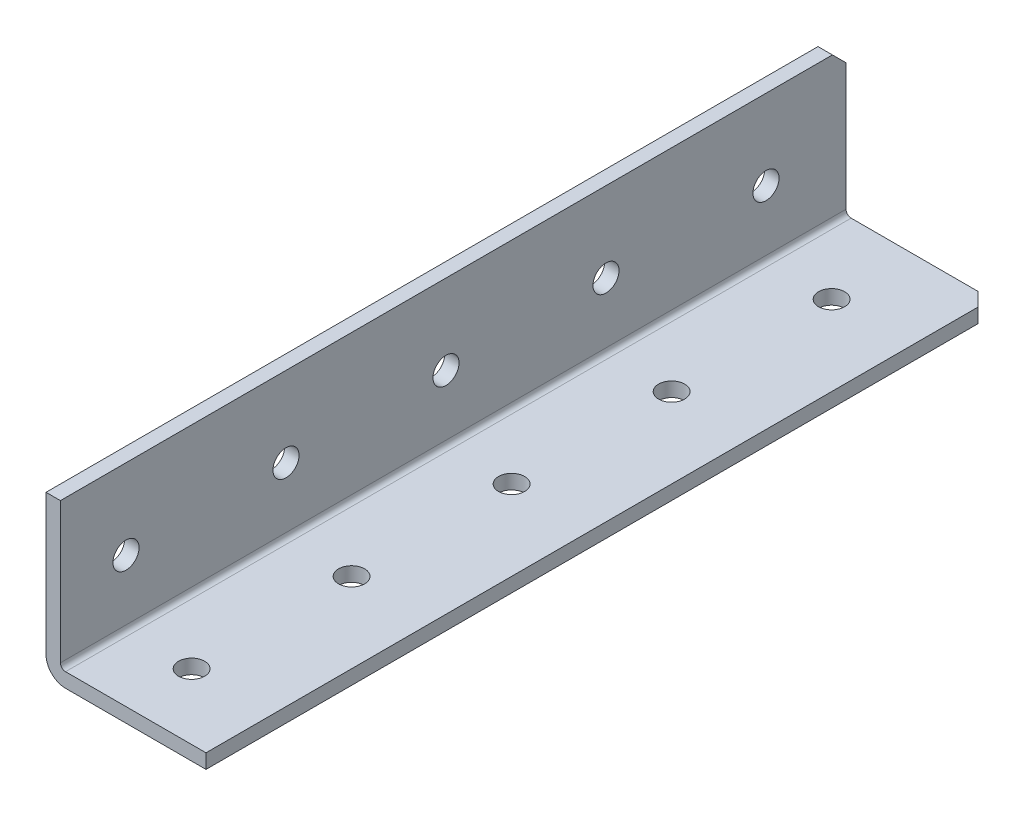
ISO-10303-21;
HEADER;
FILE_DESCRIPTION(('STEP AP214'),'2;1');
FILE_NAME('part.step','',(''),(''),'','','');
FILE_SCHEMA(('AUTOMOTIVE_DESIGN { 1 0 10303 214 1 1 1 1 }'));
ENDSEC;
DATA;
#1=APPLICATION_CONTEXT('core data for automotive mechanical design processes');
#2=APPLICATION_PROTOCOL_DEFINITION('international standard','automotive_design',2000,#1);
#3=PRODUCT_CONTEXT('',#1,'mechanical');
#4=PRODUCT('Part','Part','',(#3));
#5=PRODUCT_RELATED_PRODUCT_CATEGORY('part','',(#4));
#6=PRODUCT_DEFINITION_FORMATION('','',#4);
#7=PRODUCT_DEFINITION_CONTEXT('part definition',#1,'design');
#8=PRODUCT_DEFINITION('design','',#6,#7);
#9=PRODUCT_DEFINITION_SHAPE('','',#8);
#10=(LENGTH_UNIT() NAMED_UNIT(*) SI_UNIT(.MILLI.,.METRE.));
#11=(NAMED_UNIT(*) PLANE_ANGLE_UNIT() SI_UNIT($,.RADIAN.));
#12=(NAMED_UNIT(*) SI_UNIT($,.STERADIAN.) SOLID_ANGLE_UNIT());
#13=UNCERTAINTY_MEASURE_WITH_UNIT(LENGTH_MEASURE(1.E-05),#10,'distance_accuracy_value','');
#14=(GEOMETRIC_REPRESENTATION_CONTEXT(3) GLOBAL_UNCERTAINTY_ASSIGNED_CONTEXT((#13)) GLOBAL_UNIT_ASSIGNED_CONTEXT((#10,
#11,#12)) REPRESENTATION_CONTEXT('',''));
#15=CARTESIAN_POINT('',(0.,0.,0.));
#16=DIRECTION('',(0.,0.,1.));
#17=DIRECTION('',(1.,0.,0.));
#18=AXIS2_PLACEMENT_3D('',#15,#16,#17);
#19=CARTESIAN_POINT('',(25.4,0.,-749.3));
#20=DIRECTION('',(0.,-1.,0.));
#21=DIRECTION('',(0.,0.,-1.));
#22=AXIS2_PLACEMENT_3D('',#19,#20,#21);
#23=PLANE('',#22);
#24=DIRECTION('',(1.,0.,0.));
#25=VECTOR('',#24,1.);
#26=CARTESIAN_POINT('',(25.4,0.,-624.586));
#27=LINE('',#26,#25);
#28=CARTESIAN_POINT('',(3.0988,0.,-624.586));
#29=VERTEX_POINT('',#28);
#30=CARTESIAN_POINT('',(25.4,0.,-624.586));
#31=VERTEX_POINT('',#30);
#32=EDGE_CURVE('E110',#29,#31,#27,.T.);
#33=ORIENTED_EDGE('',*,*,#32,.F.);
#34=DIRECTION('',(0.,0.,1.));
#35=VECTOR('',#34,1.);
#36=CARTESIAN_POINT('',(3.0988,0.,-749.3));
#37=LINE('',#36,#35);
#38=CARTESIAN_POINT('',(3.0988,0.,-749.3));
#39=VERTEX_POINT('',#38);
#40=EDGE_CURVE('E56',#29,#39,#37,.F.);
#41=ORIENTED_EDGE('',*,*,#40,.T.);
#42=DIRECTION('',(-1.,0.,0.));
#43=VECTOR('',#42,1.);
#44=CARTESIAN_POINT('',(25.4,0.,-749.3));
#45=LINE('',#44,#43);
#46=CARTESIAN_POINT('',(23.2409999999998,0.,-749.3));
#47=VERTEX_POINT('',#46);
#48=EDGE_CURVE('E155',#47,#39,#45,.T.);
#49=ORIENTED_EDGE('',*,*,#48,.F.);
#50=DIRECTION('',(0.707106781186584,0.,0.707106781186511));
#51=VECTOR('',#50,1.);
#52=CARTESIAN_POINT('',(24.3205,0.,-748.2205));
#53=LINE('',#52,#51);
#54=CARTESIAN_POINT('',(25.4,0.,-747.141));
#55=VERTEX_POINT('',#54);
#56=EDGE_CURVE('E147',#47,#55,#53,.T.);
#57=ORIENTED_EDGE('',*,*,#56,.T.);
#58=DIRECTION('',(0.,0.,1.));
#59=VECTOR('',#58,1.);
#60=CARTESIAN_POINT('',(25.4,0.,-749.3));
#61=LINE('',#60,#59);
#62=EDGE_CURVE('E118',#55,#31,#61,.T.);
#63=ORIENTED_EDGE('',*,*,#62,.T.);
#64=EDGE_LOOP('',(#33,#41,#49,#57,#63));
#65=FACE_BOUND('',#64,.T.);
#66=CARTESIAN_POINT('',(12.7,0.,-736.6));
#67=DIRECTION('',(0.,-1.,0.));
#68=DIRECTION('',(0.,0.,-1.));
#69=AXIS2_PLACEMENT_3D('',#66,#67,#68);
#70=CIRCLE('',#69,2.07009999999995);
#71=CARTESIAN_POINT('',(12.7,0.,-738.6701));
#72=VERTEX_POINT('',#71);
#73=EDGE_CURVE('E160',#72,#72,#70,.T.);
#74=ORIENTED_EDGE('',*,*,#73,.F.);
#75=EDGE_LOOP('',(#74));
#76=FACE_BOUND('',#75,.T.);
#77=CARTESIAN_POINT('',(12.7,0.,-711.2));
#78=DIRECTION('',(0.,-1.,0.));
#79=DIRECTION('',(0.,0.,-1.));
#80=AXIS2_PLACEMENT_3D('',#77,#78,#79);
#81=CIRCLE('',#80,2.07009999999995);
#82=CARTESIAN_POINT('',(12.7,0.,-713.2701));
#83=VERTEX_POINT('',#82);
#84=EDGE_CURVE('E159',#83,#83,#81,.T.);
#85=ORIENTED_EDGE('',*,*,#84,.F.);
#86=EDGE_LOOP('',(#85));
#87=FACE_BOUND('',#86,.T.);
#88=CARTESIAN_POINT('',(12.7,0.,-685.8));
#89=DIRECTION('',(0.,-1.,0.));
#90=DIRECTION('',(0.,0.,-1.));
#91=AXIS2_PLACEMENT_3D('',#88,#89,#90);
#92=CIRCLE('',#91,2.07009999999995);
#93=CARTESIAN_POINT('',(12.7,0.,-687.8701));
#94=VERTEX_POINT('',#93);
#95=EDGE_CURVE('E192',#94,#94,#92,.T.);
#96=ORIENTED_EDGE('',*,*,#95,.F.);
#97=EDGE_LOOP('',(#96));
#98=FACE_BOUND('',#97,.T.);
#99=CARTESIAN_POINT('',(12.7,0.,-660.4));
#100=DIRECTION('',(0.,-1.,0.));
#101=DIRECTION('',(0.,0.,-1.));
#102=AXIS2_PLACEMENT_3D('',#99,#100,#101);
#103=CIRCLE('',#102,2.07009999999995);
#104=CARTESIAN_POINT('',(12.7,0.,-662.4701));
#105=VERTEX_POINT('',#104);
#106=EDGE_CURVE('E186',#105,#105,#103,.T.);
#107=ORIENTED_EDGE('',*,*,#106,.F.);
#108=EDGE_LOOP('',(#107));
#109=FACE_BOUND('',#108,.T.);
#110=CARTESIAN_POINT('',(12.7,0.,-635.));
#111=DIRECTION('',(0.,-1.,0.));
#112=DIRECTION('',(0.,0.,-1.));
#113=AXIS2_PLACEMENT_3D('',#110,#111,#112);
#114=CIRCLE('',#113,2.07009999999995);
#115=CARTESIAN_POINT('',(12.7,0.,-637.0701));
#116=VERTEX_POINT('',#115);
#117=EDGE_CURVE('E180',#116,#116,#114,.T.);
#118=ORIENTED_EDGE('',*,*,#117,.F.);
#119=EDGE_LOOP('',(#118));
#120=FACE_BOUND('',#119,.T.);
#121=ADVANCED_FACE('F34',(#65,#76,#87,#98,#109,#120),#23,.T.);
#122=CARTESIAN_POINT('',(25.4,25.4,-749.3));
#123=DIRECTION('',(0.,0.,-1.));
#124=DIRECTION('',(-1.,0.,0.));
#125=AXIS2_PLACEMENT_3D('',#122,#123,#124);
#126=PLANE('',#125);
#127=ORIENTED_EDGE('',*,*,#48,.T.);
#128=CARTESIAN_POINT('',(3.0988,3.0988,-749.3));
#129=DIRECTION('',(0.,0.,-1.));
#130=DIRECTION('',(-1.,0.,0.));
#131=AXIS2_PLACEMENT_3D('',#128,#129,#130);
#132=CIRCLE('',#131,3.0988);
#133=CARTESIAN_POINT('',(0.,3.0988,-749.3));
#134=VERTEX_POINT('',#133);
#135=EDGE_CURVE('E42',#39,#134,#132,.T.);
#136=ORIENTED_EDGE('',*,*,#135,.T.);
#137=DIRECTION('',(0.,-1.,0.));
#138=VECTOR('',#137,1.);
#139=CARTESIAN_POINT('',(0.,25.4,-749.3));
#140=LINE('',#139,#138);
#141=CARTESIAN_POINT('',(0.,23.241,-749.3));
#142=VERTEX_POINT('',#141);
#143=EDGE_CURVE('E162',#142,#134,#140,.T.);
#144=ORIENTED_EDGE('',*,*,#143,.F.);
#145=DIRECTION('',(1.,0.,0.));
#146=VECTOR('',#145,1.);
#147=CARTESIAN_POINT('',(25.4,23.241,-749.3));
#148=LINE('',#147,#146);
#149=CARTESIAN_POINT('',(2.286,23.241,-749.3));
#150=VERTEX_POINT('',#149);
#151=EDGE_CURVE('E152',#142,#150,#148,.T.);
#152=ORIENTED_EDGE('',*,*,#151,.T.);
#153=DIRECTION('',(0.,1.,0.));
#154=VECTOR('',#153,1.);
#155=CARTESIAN_POINT('',(2.286,2.286,-749.3));
#156=LINE('',#155,#154);
#157=CARTESIAN_POINT('',(2.286,3.0988,-749.3));
#158=VERTEX_POINT('',#157);
#159=EDGE_CURVE('E171',#158,#150,#156,.T.);
#160=ORIENTED_EDGE('',*,*,#159,.F.);
#161=CARTESIAN_POINT('',(3.0988,3.0988,-749.3));
#162=DIRECTION('',(0.,0.,-1.));
#163=DIRECTION('',(-1.,0.,0.));
#164=AXIS2_PLACEMENT_3D('',#161,#162,#163);
#165=CIRCLE('',#164,0.8128);
#166=CARTESIAN_POINT('',(3.0988,2.286,-749.3));
#167=VERTEX_POINT('',#166);
#168=EDGE_CURVE('E125',#158,#167,#165,.F.);
#169=ORIENTED_EDGE('',*,*,#168,.T.);
#170=DIRECTION('',(-1.,0.,0.));
#171=VECTOR('',#170,1.);
#172=CARTESIAN_POINT('',(25.4,2.286,-749.3));
#173=LINE('',#172,#171);
#174=CARTESIAN_POINT('',(23.2409999999998,2.286,-749.3));
#175=VERTEX_POINT('',#174);
#176=EDGE_CURVE('E174',#175,#167,#173,.T.);
#177=ORIENTED_EDGE('',*,*,#176,.F.);
#178=DIRECTION('',(0.,-1.,0.));
#179=VECTOR('',#178,1.);
#180=CARTESIAN_POINT('',(23.2409999999998,0.,-749.3));
#181=LINE('',#180,#179);
#182=EDGE_CURVE('E149',#175,#47,#181,.T.);
#183=ORIENTED_EDGE('',*,*,#182,.T.);
#184=EDGE_LOOP('',(#127,#136,#144,#152,#160,#169,#177,#183));
#185=FACE_BOUND('',#184,.T.);
#186=ADVANCED_FACE('F259',(#185),#126,.T.);
#187=CARTESIAN_POINT('',(25.4,25.4,749.3));
#188=DIRECTION('',(0.,1.,0.));
#189=DIRECTION('',(0.,0.,1.));
#190=AXIS2_PLACEMENT_3D('',#187,#188,#189);
#191=PLANE('',#190);
#192=DIRECTION('',(-1.,0.,0.));
#193=VECTOR('',#192,1.);
#194=CARTESIAN_POINT('',(25.4,25.4,-624.586));
#195=LINE('',#194,#193);
#196=CARTESIAN_POINT('',(2.286,25.4,-624.586));
#197=VERTEX_POINT('',#196);
#198=CARTESIAN_POINT('',(0.,25.4000000000002,-624.586));
#199=VERTEX_POINT('',#198);
#200=EDGE_CURVE('E120',#197,#199,#195,.T.);
#201=ORIENTED_EDGE('',*,*,#200,.F.);
#202=DIRECTION('',(0.,0.,-1.));
#203=VECTOR('',#202,1.);
#204=CARTESIAN_POINT('',(2.286,25.4,749.3));
#205=LINE('',#204,#203);
#206=CARTESIAN_POINT('',(2.286,25.4,-747.141));
#207=VERTEX_POINT('',#206);
#208=EDGE_CURVE('E167',#197,#207,#205,.T.);
#209=ORIENTED_EDGE('',*,*,#208,.T.);
#210=DIRECTION('',(-1.,0.,0.));
#211=VECTOR('',#210,1.);
#212=CARTESIAN_POINT('',(25.4,25.4,-747.141));
#213=LINE('',#212,#211);
#214=CARTESIAN_POINT('',(0.,25.4000000000002,-747.140999999999));
#215=VERTEX_POINT('',#214);
#216=EDGE_CURVE('E139',#207,#215,#213,.T.);
#217=ORIENTED_EDGE('',*,*,#216,.T.);
#218=DIRECTION('',(0.,0.,-1.));
#219=VECTOR('',#218,1.);
#220=CARTESIAN_POINT('',(0.,25.4,749.3));
#221=LINE('',#220,#219);
#222=EDGE_CURVE('E165',#199,#215,#221,.T.);
#223=ORIENTED_EDGE('',*,*,#222,.F.);
#224=EDGE_LOOP('',(#201,#209,#217,#223));
#225=FACE_BOUND('',#224,.T.);
#226=ADVANCED_FACE('F251',(#225),#191,.T.);
#227=CARTESIAN_POINT('',(25.4,0.,0.));
#228=DIRECTION('',(-1.,0.,0.));
#229=DIRECTION('',(0.,0.,1.));
#230=AXIS2_PLACEMENT_3D('',#227,#228,#229);
#231=PLANE('',#230);
#232=DIRECTION('',(0.,0.,-1.));
#233=VECTOR('',#232,1.);
#234=CARTESIAN_POINT('',(25.4,2.286,749.3));
#235=LINE('',#234,#233);
#236=CARTESIAN_POINT('',(25.4,2.286,-624.586));
#237=VERTEX_POINT('',#236);
#238=CARTESIAN_POINT('',(25.4000000000001,2.286,-747.141));
#239=VERTEX_POINT('',#238);
#240=EDGE_CURVE('E169',#237,#239,#235,.T.);
#241=ORIENTED_EDGE('',*,*,#240,.F.);
#242=DIRECTION('',(0.,-1.,0.));
#243=VECTOR('',#242,1.);
#244=CARTESIAN_POINT('',(25.4,0.,-624.586));
#245=LINE('',#244,#243);
#246=EDGE_CURVE('E238',#237,#31,#245,.T.);
#247=ORIENTED_EDGE('',*,*,#246,.T.);
#248=ORIENTED_EDGE('',*,*,#62,.F.);
#249=DIRECTION('',(0.,1.,0.));
#250=VECTOR('',#249,1.);
#251=CARTESIAN_POINT('',(25.4,2.286,-747.141));
#252=LINE('',#251,#250);
#253=EDGE_CURVE('E144',#55,#239,#252,.T.);
#254=ORIENTED_EDGE('',*,*,#253,.T.);
#255=EDGE_LOOP('',(#241,#247,#248,#254));
#256=FACE_BOUND('',#255,.T.);
#257=ADVANCED_FACE('F267',(#256),#231,.F.);
#258=CARTESIAN_POINT('',(0.,0.,0.));
#259=DIRECTION('',(-1.,0.,0.));
#260=DIRECTION('',(0.,0.,1.));
#261=AXIS2_PLACEMENT_3D('',#258,#259,#260);
#262=PLANE('',#261);
#263=DIRECTION('',(0.,-1.,0.));
#264=VECTOR('',#263,1.);
#265=CARTESIAN_POINT('',(0.,0.,-624.586));
#266=LINE('',#265,#264);
#267=CARTESIAN_POINT('',(0.,3.0988,-624.586));
#268=VERTEX_POINT('',#267);
#269=EDGE_CURVE('E48',#199,#268,#266,.T.);
#270=ORIENTED_EDGE('',*,*,#269,.F.);
#271=ORIENTED_EDGE('',*,*,#222,.T.);
#272=DIRECTION('',(0.,0.707106781186511,0.707106781186584));
#273=VECTOR('',#272,1.);
#274=CARTESIAN_POINT('',(0.,386.270500000001,-386.270499999961));
#275=LINE('',#274,#273);
#276=EDGE_CURVE('E137',#215,#142,#275,.F.);
#277=ORIENTED_EDGE('',*,*,#276,.T.);
#278=ORIENTED_EDGE('',*,*,#143,.T.);
#279=DIRECTION('',(0.,0.,1.));
#280=VECTOR('',#279,1.);
#281=CARTESIAN_POINT('',(0.,3.0988,0.));
#282=LINE('',#281,#280);
#283=EDGE_CURVE('E123',#134,#268,#282,.T.);
#284=ORIENTED_EDGE('',*,*,#283,.T.);
#285=EDGE_LOOP('',(#270,#271,#277,#278,#284));
#286=FACE_BOUND('',#285,.T.);
#287=CARTESIAN_POINT('',(0.,12.7,-635.));
#288=DIRECTION('',(-1.,0.,0.));
#289=DIRECTION('',(0.,0.,1.));
#290=AXIS2_PLACEMENT_3D('',#287,#288,#289);
#291=CIRCLE('',#290,2.07009999999995);
#292=CARTESIAN_POINT('',(0.,12.7,-632.9299));
#293=VERTEX_POINT('',#292);
#294=EDGE_CURVE('E229',#293,#293,#291,.T.);
#295=ORIENTED_EDGE('',*,*,#294,.F.);
#296=EDGE_LOOP('',(#295));
#297=FACE_BOUND('',#296,.T.);
#298=CARTESIAN_POINT('',(0.,12.7,-660.4));
#299=DIRECTION('',(-1.,0.,0.));
#300=DIRECTION('',(0.,0.,1.));
#301=AXIS2_PLACEMENT_3D('',#298,#299,#300);
#302=CIRCLE('',#301,2.07009999999995);
#303=CARTESIAN_POINT('',(0.,12.7,-658.3299));
#304=VERTEX_POINT('',#303);
#305=EDGE_CURVE('E223',#304,#304,#302,.T.);
#306=ORIENTED_EDGE('',*,*,#305,.F.);
#307=EDGE_LOOP('',(#306));
#308=FACE_BOUND('',#307,.T.);
#309=CARTESIAN_POINT('',(0.,12.7,-685.8));
#310=DIRECTION('',(-1.,0.,0.));
#311=DIRECTION('',(0.,0.,1.));
#312=AXIS2_PLACEMENT_3D('',#309,#310,#311);
#313=CIRCLE('',#312,2.07009999999995);
#314=CARTESIAN_POINT('',(0.,12.7,-683.7299));
#315=VERTEX_POINT('',#314);
#316=EDGE_CURVE('E217',#315,#315,#313,.T.);
#317=ORIENTED_EDGE('',*,*,#316,.F.);
#318=EDGE_LOOP('',(#317));
#319=FACE_BOUND('',#318,.T.);
#320=CARTESIAN_POINT('',(0.,12.7,-711.2));
#321=DIRECTION('',(-1.,0.,0.));
#322=DIRECTION('',(0.,0.,1.));
#323=AXIS2_PLACEMENT_3D('',#320,#321,#322);
#324=CIRCLE('',#323,2.07009999999995);
#325=CARTESIAN_POINT('',(0.,12.7,-709.1299));
#326=VERTEX_POINT('',#325);
#327=EDGE_CURVE('E211',#326,#326,#324,.T.);
#328=ORIENTED_EDGE('',*,*,#327,.F.);
#329=EDGE_LOOP('',(#328));
#330=FACE_BOUND('',#329,.T.);
#331=CARTESIAN_POINT('',(0.,12.7,-736.6));
#332=DIRECTION('',(-1.,0.,0.));
#333=DIRECTION('',(0.,0.,1.));
#334=AXIS2_PLACEMENT_3D('',#331,#332,#333);
#335=CIRCLE('',#334,2.07009999999995);
#336=CARTESIAN_POINT('',(0.,12.7,-734.5299));
#337=VERTEX_POINT('',#336);
#338=EDGE_CURVE('E205',#337,#337,#335,.T.);
#339=ORIENTED_EDGE('',*,*,#338,.F.);
#340=EDGE_LOOP('',(#339));
#341=FACE_BOUND('',#340,.T.);
#342=ADVANCED_FACE('F248',(#286,#297,#308,#319,#330,#341),#262,.T.);
#343=CARTESIAN_POINT('',(2.286,2.286,749.3));
#344=DIRECTION('',(-1.,0.,0.));
#345=DIRECTION('',(0.,0.,1.));
#346=AXIS2_PLACEMENT_3D('',#343,#344,#345);
#347=PLANE('',#346);
#348=CARTESIAN_POINT('',(2.286,12.7,-635.));
#349=DIRECTION('',(-1.,0.,0.));
#350=DIRECTION('',(0.,0.,1.));
#351=AXIS2_PLACEMENT_3D('',#348,#349,#350);
#352=CIRCLE('',#351,2.07009999999995);
#353=CARTESIAN_POINT('',(2.286,12.7,-632.9299));
#354=VERTEX_POINT('',#353);
#355=EDGE_CURVE('E226',#354,#354,#352,.T.);
#356=ORIENTED_EDGE('',*,*,#355,.T.);
#357=EDGE_LOOP('',(#356));
#358=FACE_BOUND('',#357,.T.);
#359=CARTESIAN_POINT('',(2.286,12.7,-660.4));
#360=DIRECTION('',(-1.,0.,0.));
#361=DIRECTION('',(0.,0.,1.));
#362=AXIS2_PLACEMENT_3D('',#359,#360,#361);
#363=CIRCLE('',#362,2.07009999999995);
#364=CARTESIAN_POINT('',(2.286,12.7,-658.3299));
#365=VERTEX_POINT('',#364);
#366=EDGE_CURVE('E220',#365,#365,#363,.T.);
#367=ORIENTED_EDGE('',*,*,#366,.T.);
#368=EDGE_LOOP('',(#367));
#369=FACE_BOUND('',#368,.T.);
#370=CARTESIAN_POINT('',(2.286,12.7,-685.8));
#371=DIRECTION('',(-1.,0.,0.));
#372=DIRECTION('',(0.,0.,1.));
#373=AXIS2_PLACEMENT_3D('',#370,#371,#372);
#374=CIRCLE('',#373,2.07009999999995);
#375=CARTESIAN_POINT('',(2.286,12.7,-683.7299));
#376=VERTEX_POINT('',#375);
#377=EDGE_CURVE('E214',#376,#376,#374,.T.);
#378=ORIENTED_EDGE('',*,*,#377,.T.);
#379=EDGE_LOOP('',(#378));
#380=FACE_BOUND('',#379,.T.);
#381=CARTESIAN_POINT('',(2.286,12.7,-711.2));
#382=DIRECTION('',(-1.,0.,0.));
#383=DIRECTION('',(0.,0.,1.));
#384=AXIS2_PLACEMENT_3D('',#381,#382,#383);
#385=CIRCLE('',#384,2.07009999999995);
#386=CARTESIAN_POINT('',(2.286,12.7,-709.1299));
#387=VERTEX_POINT('',#386);
#388=EDGE_CURVE('E208',#387,#387,#385,.T.);
#389=ORIENTED_EDGE('',*,*,#388,.T.);
#390=EDGE_LOOP('',(#389));
#391=FACE_BOUND('',#390,.T.);
#392=CARTESIAN_POINT('',(2.286,12.7,-736.6));
#393=DIRECTION('',(-1.,0.,0.));
#394=DIRECTION('',(0.,0.,1.));
#395=AXIS2_PLACEMENT_3D('',#392,#393,#394);
#396=CIRCLE('',#395,2.07009999999995);
#397=CARTESIAN_POINT('',(2.286,12.7,-734.5299));
#398=VERTEX_POINT('',#397);
#399=EDGE_CURVE('E202',#398,#398,#396,.T.);
#400=ORIENTED_EDGE('',*,*,#399,.T.);
#401=EDGE_LOOP('',(#400));
#402=FACE_BOUND('',#401,.T.);
#403=ORIENTED_EDGE('',*,*,#208,.F.);
#404=DIRECTION('',(0.,-1.,0.));
#405=VECTOR('',#404,1.);
#406=CARTESIAN_POINT('',(2.286,2.286,-624.586));
#407=LINE('',#406,#405);
#408=CARTESIAN_POINT('',(2.286,3.0988,-624.586));
#409=VERTEX_POINT('',#408);
#410=EDGE_CURVE('E119',#197,#409,#407,.T.);
#411=ORIENTED_EDGE('',*,*,#410,.T.);
#412=DIRECTION('',(0.,0.,-1.));
#413=VECTOR('',#412,1.);
#414=CARTESIAN_POINT('',(2.286,3.0988,-749.3));
#415=LINE('',#414,#413);
#416=EDGE_CURVE('E132',#409,#158,#415,.T.);
#417=ORIENTED_EDGE('',*,*,#416,.T.);
#418=ORIENTED_EDGE('',*,*,#159,.T.);
#419=DIRECTION('',(0.,-0.707106781186511,-0.707106781186584));
#420=VECTOR('',#419,1.);
#421=CARTESIAN_POINT('',(2.286,25.4,-747.141));
#422=LINE('',#421,#420);
#423=EDGE_CURVE('E134',#150,#207,#422,.F.);
#424=ORIENTED_EDGE('',*,*,#423,.T.);
#425=EDGE_LOOP('',(#403,#411,#417,#418,#424));
#426=FACE_BOUND('',#425,.T.);
#427=ADVANCED_FACE('F278',(#358,#369,#380,#391,#402,#426),#347,.F.);
#428=CARTESIAN_POINT('',(25.4,2.286,749.3));
#429=DIRECTION('',(0.,-1.,0.));
#430=DIRECTION('',(0.,0.,-1.));
#431=AXIS2_PLACEMENT_3D('',#428,#429,#430);
#432=PLANE('',#431);
#433=CARTESIAN_POINT('',(12.7,2.286,-736.6));
#434=DIRECTION('',(0.,-1.,0.));
#435=DIRECTION('',(0.,0.,-1.));
#436=AXIS2_PLACEMENT_3D('',#433,#434,#435);
#437=CIRCLE('',#436,2.07009999999995);
#438=CARTESIAN_POINT('',(12.7,2.286,-738.6701));
#439=VERTEX_POINT('',#438);
#440=EDGE_CURVE('E156',#439,#439,#437,.T.);
#441=ORIENTED_EDGE('',*,*,#440,.T.);
#442=EDGE_LOOP('',(#441));
#443=FACE_BOUND('',#442,.T.);
#444=CARTESIAN_POINT('',(12.7,2.286,-711.2));
#445=DIRECTION('',(0.,-1.,0.));
#446=DIRECTION('',(0.,0.,-1.));
#447=AXIS2_PLACEMENT_3D('',#444,#445,#446);
#448=CIRCLE('',#447,2.07009999999995);
#449=CARTESIAN_POINT('',(12.7,2.286,-713.2701));
#450=VERTEX_POINT('',#449);
#451=EDGE_CURVE('E195',#450,#450,#448,.T.);
#452=ORIENTED_EDGE('',*,*,#451,.T.);
#453=EDGE_LOOP('',(#452));
#454=FACE_BOUND('',#453,.T.);
#455=CARTESIAN_POINT('',(12.7,2.286,-685.8));
#456=DIRECTION('',(0.,-1.,0.));
#457=DIRECTION('',(0.,0.,-1.));
#458=AXIS2_PLACEMENT_3D('',#455,#456,#457);
#459=CIRCLE('',#458,2.07009999999995);
#460=CARTESIAN_POINT('',(12.7,2.286,-687.8701));
#461=VERTEX_POINT('',#460);
#462=EDGE_CURVE('E189',#461,#461,#459,.T.);
#463=ORIENTED_EDGE('',*,*,#462,.T.);
#464=EDGE_LOOP('',(#463));
#465=FACE_BOUND('',#464,.T.);
#466=CARTESIAN_POINT('',(12.7,2.286,-660.4));
#467=DIRECTION('',(0.,-1.,0.));
#468=DIRECTION('',(0.,0.,-1.));
#469=AXIS2_PLACEMENT_3D('',#466,#467,#468);
#470=CIRCLE('',#469,2.07009999999995);
#471=CARTESIAN_POINT('',(12.7,2.286,-662.4701));
#472=VERTEX_POINT('',#471);
#473=EDGE_CURVE('E183',#472,#472,#470,.T.);
#474=ORIENTED_EDGE('',*,*,#473,.T.);
#475=EDGE_LOOP('',(#474));
#476=FACE_BOUND('',#475,.T.);
#477=CARTESIAN_POINT('',(12.7,2.286,-635.));
#478=DIRECTION('',(0.,-1.,0.));
#479=DIRECTION('',(0.,0.,-1.));
#480=AXIS2_PLACEMENT_3D('',#477,#478,#479);
#481=CIRCLE('',#480,2.07009999999995);
#482=CARTESIAN_POINT('',(12.7,2.286,-637.0701));
#483=VERTEX_POINT('',#482);
#484=EDGE_CURVE('E177',#483,#483,#481,.T.);
#485=ORIENTED_EDGE('',*,*,#484,.T.);
#486=EDGE_LOOP('',(#485));
#487=FACE_BOUND('',#486,.T.);
#488=DIRECTION('',(0.,0.,-1.));
#489=VECTOR('',#488,1.);
#490=CARTESIAN_POINT('',(3.0988,2.286,749.3));
#491=LINE('',#490,#489);
#492=CARTESIAN_POINT('',(3.0988,2.286,-624.586));
#493=VERTEX_POINT('',#492);
#494=EDGE_CURVE('E129',#167,#493,#491,.F.);
#495=ORIENTED_EDGE('',*,*,#494,.T.);
#496=DIRECTION('',(1.,0.,0.));
#497=VECTOR('',#496,1.);
#498=CARTESIAN_POINT('',(25.4,2.286,-624.586));
#499=LINE('',#498,#497);
#500=EDGE_CURVE('E232',#493,#237,#499,.T.);
#501=ORIENTED_EDGE('',*,*,#500,.T.);
#502=ORIENTED_EDGE('',*,*,#240,.T.);
#503=DIRECTION('',(-0.707106781186584,0.,-0.707106781186511));
#504=VECTOR('',#503,1.);
#505=CARTESIAN_POINT('',(23.2409999999998,2.286,-749.3));
#506=LINE('',#505,#504);
#507=EDGE_CURVE('E142',#239,#175,#506,.T.);
#508=ORIENTED_EDGE('',*,*,#507,.T.);
#509=ORIENTED_EDGE('',*,*,#176,.T.);
#510=EDGE_LOOP('',(#495,#501,#502,#508,#509));
#511=FACE_BOUND('',#510,.T.);
#512=ADVANCED_FACE('F271',(#443,#454,#465,#476,#487,#511),#432,.F.);
#513=CARTESIAN_POINT('',(12.7,0.,-635.));
#514=DIRECTION('',(0.,-1.,0.));
#515=DIRECTION('',(0.,0.,-1.));
#516=AXIS2_PLACEMENT_3D('',#513,#514,#515);
#517=CYLINDRICAL_SURFACE('',#516,2.07009999999995);
#518=ORIENTED_EDGE('',*,*,#117,.T.);
#519=EDGE_LOOP('',(#518));
#520=FACE_BOUND('',#519,.T.);
#521=ORIENTED_EDGE('',*,*,#484,.F.);
#522=EDGE_LOOP('',(#521));
#523=FACE_BOUND('',#522,.T.);
#524=ADVANCED_FACE('F286',(#520,#523),#517,.F.);
#525=CARTESIAN_POINT('',(12.7,0.,-660.4));
#526=DIRECTION('',(0.,-1.,0.));
#527=DIRECTION('',(0.,0.,-1.));
#528=AXIS2_PLACEMENT_3D('',#525,#526,#527);
#529=CYLINDRICAL_SURFACE('',#528,2.07009999999995);
#530=ORIENTED_EDGE('',*,*,#106,.T.);
#531=EDGE_LOOP('',(#530));
#532=FACE_BOUND('',#531,.T.);
#533=ORIENTED_EDGE('',*,*,#473,.F.);
#534=EDGE_LOOP('',(#533));
#535=FACE_BOUND('',#534,.T.);
#536=ADVANCED_FACE('F347',(#532,#535),#529,.F.);
#537=CARTESIAN_POINT('',(12.7,0.,-685.8));
#538=DIRECTION('',(0.,-1.,0.));
#539=DIRECTION('',(0.,0.,-1.));
#540=AXIS2_PLACEMENT_3D('',#537,#538,#539);
#541=CYLINDRICAL_SURFACE('',#540,2.07009999999995);
#542=ORIENTED_EDGE('',*,*,#95,.T.);
#543=EDGE_LOOP('',(#542));
#544=FACE_BOUND('',#543,.T.);
#545=ORIENTED_EDGE('',*,*,#462,.F.);
#546=EDGE_LOOP('',(#545));
#547=FACE_BOUND('',#546,.T.);
#548=ADVANCED_FACE('F343',(#544,#547),#541,.F.);
#549=CARTESIAN_POINT('',(12.7,0.,-711.2));
#550=DIRECTION('',(0.,-1.,0.));
#551=DIRECTION('',(0.,0.,-1.));
#552=AXIS2_PLACEMENT_3D('',#549,#550,#551);
#553=CYLINDRICAL_SURFACE('',#552,2.07009999999995);
#554=ORIENTED_EDGE('',*,*,#84,.T.);
#555=EDGE_LOOP('',(#554));
#556=FACE_BOUND('',#555,.T.);
#557=ORIENTED_EDGE('',*,*,#451,.F.);
#558=EDGE_LOOP('',(#557));
#559=FACE_BOUND('',#558,.T.);
#560=ADVANCED_FACE('F339',(#556,#559),#553,.F.);
#561=CARTESIAN_POINT('',(12.7,0.,-736.6));
#562=DIRECTION('',(0.,-1.,0.));
#563=DIRECTION('',(0.,0.,-1.));
#564=AXIS2_PLACEMENT_3D('',#561,#562,#563);
#565=CYLINDRICAL_SURFACE('',#564,2.07009999999995);
#566=ORIENTED_EDGE('',*,*,#73,.T.);
#567=EDGE_LOOP('',(#566));
#568=FACE_BOUND('',#567,.T.);
#569=ORIENTED_EDGE('',*,*,#440,.F.);
#570=EDGE_LOOP('',(#569));
#571=FACE_BOUND('',#570,.T.);
#572=ADVANCED_FACE('F335',(#568,#571),#565,.F.);
#573=CARTESIAN_POINT('',(0.,12.7,-736.6));
#574=DIRECTION('',(-1.,0.,0.));
#575=DIRECTION('',(0.,0.,1.));
#576=AXIS2_PLACEMENT_3D('',#573,#574,#575);
#577=CYLINDRICAL_SURFACE('',#576,2.07009999999995);
#578=ORIENTED_EDGE('',*,*,#338,.T.);
#579=EDGE_LOOP('',(#578));
#580=FACE_BOUND('',#579,.T.);
#581=ORIENTED_EDGE('',*,*,#399,.F.);
#582=EDGE_LOOP('',(#581));
#583=FACE_BOUND('',#582,.T.);
#584=ADVANCED_FACE('F331',(#580,#583),#577,.F.);
#585=CARTESIAN_POINT('',(0.,12.7,-711.2));
#586=DIRECTION('',(-1.,0.,0.));
#587=DIRECTION('',(0.,0.,1.));
#588=AXIS2_PLACEMENT_3D('',#585,#586,#587);
#589=CYLINDRICAL_SURFACE('',#588,2.07009999999995);
#590=ORIENTED_EDGE('',*,*,#327,.T.);
#591=EDGE_LOOP('',(#590));
#592=FACE_BOUND('',#591,.T.);
#593=ORIENTED_EDGE('',*,*,#388,.F.);
#594=EDGE_LOOP('',(#593));
#595=FACE_BOUND('',#594,.T.);
#596=ADVANCED_FACE('F327',(#592,#595),#589,.F.);
#597=CARTESIAN_POINT('',(0.,12.7,-685.8));
#598=DIRECTION('',(-1.,0.,0.));
#599=DIRECTION('',(0.,0.,1.));
#600=AXIS2_PLACEMENT_3D('',#597,#598,#599);
#601=CYLINDRICAL_SURFACE('',#600,2.07009999999995);
#602=ORIENTED_EDGE('',*,*,#316,.T.);
#603=EDGE_LOOP('',(#602));
#604=FACE_BOUND('',#603,.T.);
#605=ORIENTED_EDGE('',*,*,#377,.F.);
#606=EDGE_LOOP('',(#605));
#607=FACE_BOUND('',#606,.T.);
#608=ADVANCED_FACE('F323',(#604,#607),#601,.F.);
#609=CARTESIAN_POINT('',(0.,12.7,-660.4));
#610=DIRECTION('',(-1.,0.,0.));
#611=DIRECTION('',(0.,0.,1.));
#612=AXIS2_PLACEMENT_3D('',#609,#610,#611);
#613=CYLINDRICAL_SURFACE('',#612,2.07009999999995);
#614=ORIENTED_EDGE('',*,*,#305,.T.);
#615=EDGE_LOOP('',(#614));
#616=FACE_BOUND('',#615,.T.);
#617=ORIENTED_EDGE('',*,*,#366,.F.);
#618=EDGE_LOOP('',(#617));
#619=FACE_BOUND('',#618,.T.);
#620=ADVANCED_FACE('F319',(#616,#619),#613,.F.);
#621=CARTESIAN_POINT('',(0.,12.7,-635.));
#622=DIRECTION('',(-1.,0.,0.));
#623=DIRECTION('',(0.,0.,1.));
#624=AXIS2_PLACEMENT_3D('',#621,#622,#623);
#625=CYLINDRICAL_SURFACE('',#624,2.07009999999995);
#626=ORIENTED_EDGE('',*,*,#294,.T.);
#627=EDGE_LOOP('',(#626));
#628=FACE_BOUND('',#627,.T.);
#629=ORIENTED_EDGE('',*,*,#355,.F.);
#630=EDGE_LOOP('',(#629));
#631=FACE_BOUND('',#630,.T.);
#632=ADVANCED_FACE('F304',(#628,#631),#625,.F.);
#633=CARTESIAN_POINT('',(23.2409999999998,25.4,-749.3));
#634=DIRECTION('',(0.707106781186511,0.,-0.707106781186584));
#635=DIRECTION('',(0.,1.,0.));
#636=AXIS2_PLACEMENT_3D('',#633,#634,#635);
#637=PLANE('',#636);
#638=ORIENTED_EDGE('',*,*,#507,.F.);
#639=ORIENTED_EDGE('',*,*,#253,.F.);
#640=ORIENTED_EDGE('',*,*,#56,.F.);
#641=ORIENTED_EDGE('',*,*,#182,.F.);
#642=EDGE_LOOP('',(#638,#639,#640,#641));
#643=FACE_BOUND('',#642,.T.);
#644=ADVANCED_FACE('F269',(#643),#637,.T.);
#645=CARTESIAN_POINT('',(25.4,25.4,-747.141));
#646=DIRECTION('',(0.,-0.707106781186584,0.707106781186511));
#647=DIRECTION('',(-1.,0.,0.));
#648=AXIS2_PLACEMENT_3D('',#645,#646,#647);
#649=PLANE('',#648);
#650=ORIENTED_EDGE('',*,*,#423,.F.);
#651=ORIENTED_EDGE('',*,*,#151,.F.);
#652=ORIENTED_EDGE('',*,*,#276,.F.);
#653=ORIENTED_EDGE('',*,*,#216,.F.);
#654=EDGE_LOOP('',(#650,#651,#652,#653));
#655=FACE_BOUND('',#654,.T.);
#656=ADVANCED_FACE('F255',(#655),#649,.F.);
#657=CARTESIAN_POINT('',(3.0988,3.0988,749.3));
#658=DIRECTION('',(0.,0.,1.));
#659=DIRECTION('',(1.,0.,0.));
#660=AXIS2_PLACEMENT_3D('',#657,#658,#659);
#661=CYLINDRICAL_SURFACE('',#660,0.8128);
#662=ORIENTED_EDGE('',*,*,#416,.F.);
#663=CARTESIAN_POINT('',(3.0988,3.0988,-624.586));
#664=DIRECTION('',(0.,0.,-1.));
#665=DIRECTION('',(-1.,0.,0.));
#666=AXIS2_PLACEMENT_3D('',#663,#664,#665);
#667=CIRCLE('',#666,0.8128);
#668=EDGE_CURVE('E235',#409,#493,#667,.F.);
#669=ORIENTED_EDGE('',*,*,#668,.T.);
#670=ORIENTED_EDGE('',*,*,#494,.F.);
#671=ORIENTED_EDGE('',*,*,#168,.F.);
#672=EDGE_LOOP('',(#662,#669,#670,#671));
#673=FACE_BOUND('',#672,.T.);
#674=ADVANCED_FACE('F276',(#673),#661,.F.);
#675=CARTESIAN_POINT('',(3.0988,3.0988,0.));
#676=DIRECTION('',(0.,0.,1.));
#677=DIRECTION('',(1.,0.,0.));
#678=AXIS2_PLACEMENT_3D('',#675,#676,#677);
#679=CYLINDRICAL_SURFACE('',#678,3.0988);
#680=CARTESIAN_POINT('',(3.0988,3.0988,-624.586));
#681=DIRECTION('',(0.,0.,-1.));
#682=DIRECTION('',(-1.,0.,0.));
#683=AXIS2_PLACEMENT_3D('',#680,#681,#682);
#684=CIRCLE('',#683,3.0988);
#685=EDGE_CURVE('E11',#268,#29,#684,.F.);
#686=ORIENTED_EDGE('',*,*,#685,.F.);
#687=ORIENTED_EDGE('',*,*,#283,.F.);
#688=ORIENTED_EDGE('',*,*,#135,.F.);
#689=ORIENTED_EDGE('',*,*,#40,.F.);
#690=EDGE_LOOP('',(#686,#687,#688,#689));
#691=FACE_BOUND('',#690,.T.);
#692=ADVANCED_FACE('F36',(#691),#679,.T.);
#693=CARTESIAN_POINT('',(0.,0.,-624.586));
#694=DIRECTION('',(0.,0.,-1.));
#695=DIRECTION('',(-1.,0.,0.));
#696=AXIS2_PLACEMENT_3D('',#693,#694,#695);
#697=PLANE('',#696);
#698=ORIENTED_EDGE('',*,*,#668,.F.);
#699=ORIENTED_EDGE('',*,*,#410,.F.);
#700=ORIENTED_EDGE('',*,*,#200,.T.);
#701=ORIENTED_EDGE('',*,*,#269,.T.);
#702=ORIENTED_EDGE('',*,*,#685,.T.);
#703=ORIENTED_EDGE('',*,*,#32,.T.);
#704=ORIENTED_EDGE('',*,*,#246,.F.);
#705=ORIENTED_EDGE('',*,*,#500,.F.);
#706=EDGE_LOOP('',(#698,#699,#700,#701,#702,#703,#704,#705));
#707=FACE_BOUND('',#706,.T.);
#708=ADVANCED_FACE('F109',(#707),#697,.F.);
#709=CLOSED_SHELL('',(#121,#186,#226,#257,#342,#427,#512,#524,#536,#548,#560,#572,#584,#596,
#608,#620,#632,#644,#656,#674,#692,#708));
#710=MANIFOLD_SOLID_BREP('B2',#709);
#711=ADVANCED_BREP_SHAPE_REPRESENTATION('',(#18,#710),#14);
#712=SHAPE_DEFINITION_REPRESENTATION(#9,#711);
ENDSEC;
END-ISO-10303-21;
